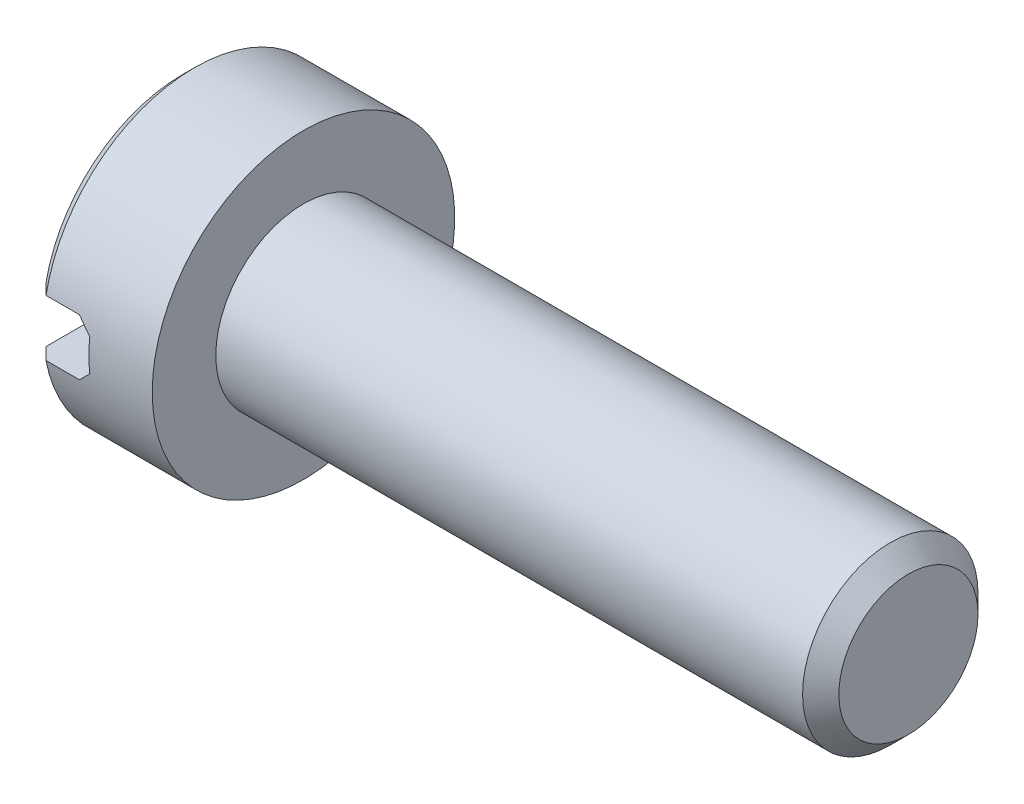
ISO-10303-21;
HEADER;
FILE_DESCRIPTION(('STEP AP214'),'2;1');
FILE_NAME('part.step','',(''),(''),'','','');
FILE_SCHEMA(('AUTOMOTIVE_DESIGN { 1 0 10303 214 1 1 1 1 }'));
ENDSEC;
DATA;
#1=APPLICATION_CONTEXT('core data for automotive mechanical design processes');
#2=APPLICATION_PROTOCOL_DEFINITION('international standard','automotive_design',2000,#1);
#3=PRODUCT_CONTEXT('',#1,'mechanical');
#4=PRODUCT('Part','Part','',(#3));
#5=PRODUCT_RELATED_PRODUCT_CATEGORY('part','',(#4));
#6=PRODUCT_DEFINITION_FORMATION('','',#4);
#7=PRODUCT_DEFINITION_CONTEXT('part definition',#1,'design');
#8=PRODUCT_DEFINITION('design','',#6,#7);
#9=PRODUCT_DEFINITION_SHAPE('','',#8);
#10=(LENGTH_UNIT() NAMED_UNIT(*) SI_UNIT(.MILLI.,.METRE.));
#11=(NAMED_UNIT(*) PLANE_ANGLE_UNIT() SI_UNIT($,.RADIAN.));
#12=(NAMED_UNIT(*) SI_UNIT($,.STERADIAN.) SOLID_ANGLE_UNIT());
#13=UNCERTAINTY_MEASURE_WITH_UNIT(LENGTH_MEASURE(1.E-05),#10,'distance_accuracy_value','');
#14=(GEOMETRIC_REPRESENTATION_CONTEXT(3) GLOBAL_UNCERTAINTY_ASSIGNED_CONTEXT((#13)) GLOBAL_UNIT_ASSIGNED_CONTEXT((#10,
#11,#12)) REPRESENTATION_CONTEXT('',''));
#15=CARTESIAN_POINT('',(0.,0.,0.));
#16=DIRECTION('',(0.,0.,1.));
#17=DIRECTION('',(1.,0.,0.));
#18=AXIS2_PLACEMENT_3D('',#15,#16,#17);
#19=CARTESIAN_POINT('',(2.,2.5,0.));
#20=DIRECTION('',(-1.,0.,0.));
#21=DIRECTION('',(0.,0.,1.));
#22=AXIS2_PLACEMENT_3D('',#19,#20,#21);
#23=PLANE('',#22);
#24=CARTESIAN_POINT('',(2.,0.,0.));
#25=DIRECTION('',(-1.,0.,0.));
#26=DIRECTION('',(0.,0.,1.));
#27=AXIS2_PLACEMENT_3D('',#24,#25,#26);
#28=CIRCLE('',#27,2.5);
#29=CARTESIAN_POINT('',(2.,0.,2.5));
#30=VERTEX_POINT('',#29);
#31=EDGE_CURVE('E191',#30,#30,#28,.T.);
#32=ORIENTED_EDGE('',*,*,#31,.F.);
#33=EDGE_LOOP('',(#32));
#34=FACE_BOUND('',#33,.T.);
#35=CARTESIAN_POINT('',(2.,0.,0.));
#36=DIRECTION('',(-1.,0.,0.));
#37=DIRECTION('',(0.,0.,1.));
#38=AXIS2_PLACEMENT_3D('',#35,#36,#37);
#39=CIRCLE('',#38,1.45);
#40=CARTESIAN_POINT('',(2.,0.,1.45));
#41=VERTEX_POINT('',#40);
#42=EDGE_CURVE('E140',#41,#41,#39,.F.);
#43=ORIENTED_EDGE('',*,*,#42,.F.);
#44=EDGE_LOOP('',(#43));
#45=FACE_BOUND('',#44,.T.);
#46=ADVANCED_FACE('F28',(#34,#45),#23,.F.);
#47=CARTESIAN_POINT('',(0.,0.,0.));
#48=DIRECTION('',(1.,0.,0.));
#49=DIRECTION('',(0.,0.,-1.));
#50=AXIS2_PLACEMENT_3D('',#47,#48,#49);
#51=PLANE('',#50);
#52=CARTESIAN_POINT('',(0.,0.,0.));
#53=DIRECTION('',(-1.,0.,0.));
#54=DIRECTION('',(0.,0.,1.));
#55=AXIS2_PLACEMENT_3D('',#52,#53,#54);
#56=CIRCLE('',#55,2.3);
#57=CARTESIAN_POINT('',(0.,0.465549348230913,2.25239068644003));
#58=VERTEX_POINT('',#57);
#59=CARTESIAN_POINT('',(0.,0.465549348230913,-2.25239068644003));
#60=VERTEX_POINT('',#59);
#61=EDGE_CURVE('E110',#58,#60,#56,.T.);
#62=ORIENTED_EDGE('',*,*,#61,.T.);
#63=DIRECTION('',(0.,0.,1.));
#64=VECTOR('',#63,1.);
#65=CARTESIAN_POINT('',(0.,0.465549348230913,-5.));
#66=LINE('',#65,#64);
#67=EDGE_CURVE('E103',#60,#58,#66,.T.);
#68=ORIENTED_EDGE('',*,*,#67,.T.);
#69=EDGE_LOOP('',(#62,#68));
#70=FACE_BOUND('',#69,.T.);
#71=ADVANCED_FACE('F158',(#70),#51,.F.);
#72=CARTESIAN_POINT('',(0.2,0.,0.));
#73=DIRECTION('',(1.,0.,0.));
#74=DIRECTION('',(0.,0.,-1.));
#75=AXIS2_PLACEMENT_3D('',#72,#73,#74);
#76=CONICAL_SURFACE('',#75,2.5,0.785398163397449);
#77=CARTESIAN_POINT('',(0.2,0.,0.));
#78=DIRECTION('',(-1.,0.,0.));
#79=DIRECTION('',(0.,0.,1.));
#80=AXIS2_PLACEMENT_3D('',#77,#78,#79);
#81=CIRCLE('',#80,2.5);
#82=CARTESIAN_POINT('',(0.2,0.465549348230913,2.45627030360296));
#83=VERTEX_POINT('',#82);
#84=CARTESIAN_POINT('',(0.2,0.465549348230913,-2.45627030360296));
#85=VERTEX_POINT('',#84);
#86=EDGE_CURVE('E111',#83,#85,#81,.T.);
#87=ORIENTED_EDGE('',*,*,#86,.T.);
#88=CARTESIAN_POINT('',(3.20259904076723,0.465549348230913,-5.48286968729098));
#89=CARTESIAN_POINT('',(3.00738145959935,0.465549348230913,-5.28694329289562));
#90=CARTESIAN_POINT('',(2.81219546067579,0.465549348230913,-5.09098538985915));
#91=CARTESIAN_POINT('',(2.42191937891038,0.465549348230913,-4.69895178557872));
#92=CARTESIAN_POINT('',(2.22682930219255,0.465549348230913,-4.50287607823863));
#93=CARTESIAN_POINT('',(1.83653240706012,0.465549348230913,-4.11030517611593));
#94=CARTESIAN_POINT('',(1.64132579611623,0.465549348230913,-3.9138097750014));
#95=CARTESIAN_POINT('',(1.25115924421648,0.465549348230913,-3.52059587027371));
#96=CARTESIAN_POINT('',(1.05619929014715,0.465549348230913,-3.32387737967476));
#97=CARTESIAN_POINT('',(0.678173026290478,0.465549348230913,-2.9416895419363));
#98=CARTESIAN_POINT('',(0.495084501131994,0.465549348230913,-2.7562421918476));
#99=CARTESIAN_POINT('',(0.220902938364085,0.465549348230913,-2.47759625217052));
#100=CARTESIAN_POINT('',(0.129576630819242,0.465549348230913,-2.38462728539378));
#101=CARTESIAN_POINT('',(-0.0528521527638664,0.465549348230913,-2.19847287291091));
#102=CARTESIAN_POINT('',(-0.143954632395984,0.465549348230913,-2.10528743072794));
#103=CARTESIAN_POINT('',(-0.325762187411694,0.465549348230913,-1.91867757427864));
#104=CARTESIAN_POINT('',(-0.416467526691369,0.465549348230913,-1.82525341749482));
#105=CARTESIAN_POINT('',(-0.597381873326261,0.465549348230913,-1.63791440165395));
#106=CARTESIAN_POINT('',(-0.687590849458516,0.465549348230913,-1.54399951243647));
#107=CARTESIAN_POINT('',(-0.867162247825724,0.465549348230913,-1.3554114454591));
#108=CARTESIAN_POINT('',(-0.956524909350582,0.465549348230913,-1.26073849690962));
#109=CARTESIAN_POINT('',(-1.08939468495382,0.465549348230913,-1.11764625640034));
#110=CARTESIAN_POINT('',(-1.1334867082123,0.465549348230913,-1.06977082072954));
#111=CARTESIAN_POINT('',(-1.2210969597667,0.465549348230913,-0.973498550024909));
#112=CARTESIAN_POINT('',(-1.26461520900373,0.465549348230913,-0.925101734137766));
#113=CARTESIAN_POINT('',(-1.3317610681347,0.465549348230913,-0.849065289158111));
#114=CARTESIAN_POINT('',(-1.35569012099074,0.465549348230913,-0.821692131835998));
#115=CARTESIAN_POINT('',(-1.40319102244514,0.465549348230913,-0.766632100193609));
#116=CARTESIAN_POINT('',(-1.42676283514449,0.465549348230913,-0.73894519482706));
#117=CARTESIAN_POINT('',(-1.47366376684455,0.465549348230913,-0.682886365346766));
#118=CARTESIAN_POINT('',(-1.49698800292058,0.465549348230913,-0.654510342179644));
#119=CARTESIAN_POINT('',(-1.54295549742156,0.465549348230913,-0.597221058712914));
#120=CARTESIAN_POINT('',(-1.56559892715386,0.465549348230913,-0.568307936573488));
#121=CARTESIAN_POINT('',(-1.61016736197608,0.465549348230913,-0.509419742712258));
#122=CARTESIAN_POINT('',(-1.63208156923063,0.465549348230913,-0.479436434264725));
#123=CARTESIAN_POINT('',(-1.67445976083722,0.465549348230913,-0.418389024408675));
#124=CARTESIAN_POINT('',(-1.69492180209863,0.465549348230913,-0.387323554832705));
#125=CARTESIAN_POINT('',(-1.73332185678116,0.465549348230913,-0.324061124181559));
#126=CARTESIAN_POINT('',(-1.75128287953761,0.465549348230913,-0.291878431816847));
#127=CARTESIAN_POINT('',(-1.78342369621955,0.465549348230913,-0.225717265309184));
#128=CARTESIAN_POINT('',(-1.79761500076547,0.465549348230913,-0.191744646392133));
#129=CARTESIAN_POINT('',(-1.81895609795713,0.465549348230913,-0.124795883091766));
#130=CARTESIAN_POINT('',(-1.8266128932659,0.465549348230913,-0.0919921322132611));
#131=CARTESIAN_POINT('',(-1.83488894775632,0.465549348230913,-0.0256267496241762));
#132=CARTESIAN_POINT('',(-1.83554895937427,0.465549348230913,0.00792935132869227));
#133=CARTESIAN_POINT('',(-1.82973306120756,0.465549348230913,0.0742464015597508));
#134=CARTESIAN_POINT('',(-1.82328333400206,0.465549348230913,0.107009817283791));
#135=CARTESIAN_POINT('',(-1.80956338762447,0.465549348230913,0.155027331571199));
#136=CARTESIAN_POINT('',(-1.80428518983903,0.465549348230913,0.170909212358321));
#137=CARTESIAN_POINT('',(-1.79261948745361,0.465549348230913,0.202260246274237));
#138=CARTESIAN_POINT('',(-1.78623214101843,0.465549348230913,0.217729457887391));
#139=CARTESIAN_POINT('',(-1.76761840023324,0.465549348230913,0.259328209218331));
#140=CARTESIAN_POINT('',(-1.7545143196465,0.465549348230913,0.285061417842786));
#141=CARTESIAN_POINT('',(-1.72651469614149,0.465549348230913,0.335544158020592));
#142=CARTESIAN_POINT('',(-1.71161720540743,0.465549348230913,0.360292580485516));
#143=CARTESIAN_POINT('',(-1.68054228203642,0.465549348230913,0.409079841714359));
#144=CARTESIAN_POINT('',(-1.66436078635795,0.465549348230913,0.433116068257987));
#145=CARTESIAN_POINT('',(-1.63111775750428,0.465549348230913,0.480575042863358));
#146=CARTESIAN_POINT('',(-1.61405601084805,0.465549348230913,0.503997640009445));
#147=CARTESIAN_POINT('',(-1.5616167270468,0.465549348230913,0.573971640763827));
#148=CARTESIAN_POINT('',(-1.52527399334495,0.465549348230913,0.619796593427046));
#149=CARTESIAN_POINT('',(-1.45124163289229,0.465549348230913,0.710149565111901));
#150=CARTESIAN_POINT('',(-1.41355526157427,0.465549348230913,0.7546802997551));
#151=CARTESIAN_POINT('',(-1.33810033893443,0.465549348230913,0.842013934301668));
#152=CARTESIAN_POINT('',(-1.30035092246978,0.465549348230913,0.884833404050981));
#153=CARTESIAN_POINT('',(-1.22427339982634,0.465549348230913,0.969954837541984));
#154=CARTESIAN_POINT('',(-1.18594527816913,0.465549348230913,1.01225678738678));
#155=CARTESIAN_POINT('',(-1.07035214447441,0.465549348230913,1.13862723555416));
#156=CARTESIAN_POINT('',(-0.992489260170284,0.465549348230913,1.22214795765609));
#157=CARTESIAN_POINT('',(-0.835814007667518,0.465549348230913,1.38847609582379));
#158=CARTESIAN_POINT('',(-0.757000620957103,0.465549348230913,1.47128254610905));
#159=CARTESIAN_POINT('',(-0.598849232799755,0.465549348230913,1.63637982121664));
#160=CARTESIAN_POINT('',(-0.519511274422271,0.465549348230913,1.71867068731607));
#161=CARTESIAN_POINT('',(-0.361217712976167,0.465549348230913,1.88216701603883));
#162=CARTESIAN_POINT('',(-0.282265248575711,0.465549348230913,1.9633755225318));
#163=CARTESIAN_POINT('',(-0.124123333736655,0.465549348230913,2.12556467511988));
#164=CARTESIAN_POINT('',(-0.044933878372658,0.465549348230913,2.20654531641042));
#165=CARTESIAN_POINT('',(0.192811054539122,0.465549348230913,2.44916767308598));
#166=CARTESIAN_POINT('',(0.351615992082501,0.465549348230913,2.61056482504039));
#167=CARTESIAN_POINT('',(0.732972757071635,0.465549348230913,2.99726131212903));
#168=CARTESIAN_POINT('',(0.955700706319338,0.465549348230913,3.22238674752163));
#169=CARTESIAN_POINT('',(1.401572977937,0.465549348230913,3.67230050679293));
#170=CARTESIAN_POINT('',(1.62471736464727,0.465549348230913,3.89708876686418));
#171=CARTESIAN_POINT('',(2.07358635321307,0.465549348230913,4.34881324556589));
#172=CARTESIAN_POINT('',(2.29931333445495,0.465549348230913,4.57574709913376));
#173=CARTESIAN_POINT('',(2.7508805263624,0.465549348230913,5.02942321622607));
#174=CARTESIAN_POINT('',(2.97672071035442,0.465549348230913,5.2561655062971));
#175=CARTESIAN_POINT('',(3.20259904076724,0.465549348230913,5.48286968729098));
#176=B_SPLINE_CURVE_WITH_KNOTS('',3,(#88,#89,#90,#91,#92,#93,#94,#95,#96,#97,#98,#99,#100,#101,
#102,#103,#104,#105,#106,#107,#108,#109,#110,#111,#112,#113,#114,#115,#116,#117,#118,#119,#120,
#121,#122,#123,#124,#125,#126,#127,#128,#129,#130,#131,#132,#133,#134,#135,#136,#137,#138,#139,
#140,#141,#142,#143,#144,#145,#146,#147,#148,#149,#150,#151,#152,#153,#154,#155,#156,#157,#158,
#159,#160,#161,#162,#163,#164,#165,#166,#167,#168,#169,#170,#171,#172,#173,#174,#175),
.UNSPECIFIED.,.F.,.F.,(4,2,2,2,2,2,2,2,2,2,2,2,2,2,2,2,2,2,2,2,2,2,2,2,2,2,2,2,2,2,2,2,2,2,2,2,
2,2,2,2,2,2,2,4),(0.,0.829743073340608,1.65953360095567,2.49046340540357,3.3213470024816,
4.10314469139847,4.49410926633512,4.88506752224857,5.27570632324448,5.66636942212084,
6.05691855181897,6.25217337755999,6.44742105722462,6.55649218217525,6.66557419594665,
6.77576205404667,6.88592195014922,6.99730763492697,7.10883965543405,7.21926609048524,
7.32935136450646,7.42981570469559,7.52969457133972,7.62920684560584,7.67938417859199,
7.72955436214783,7.81607261219315,7.90268569183183,7.9895847021618,8.07650488747965,
8.25190336684877,8.42690244879081,8.59814445390702,8.76939104731505,9.11193368974146,
9.45488345933612,9.79780541262763,10.1375912828317,10.4773842645597,11.1566564623285,
12.1067097788694,13.0569245869456,14.0171665517813,14.9772407465216),.UNSPECIFIED.);
#177=EDGE_CURVE('E51',#85,#60,#176,.T.);
#178=ORIENTED_EDGE('',*,*,#177,.T.);
#179=ORIENTED_EDGE('',*,*,#61,.F.);
#180=EDGE_CURVE('E185',#58,#83,#176,.T.);
#181=ORIENTED_EDGE('',*,*,#180,.T.);
#182=EDGE_LOOP('',(#87,#178,#179,#181));
#183=FACE_BOUND('',#182,.T.);
#184=ADVANCED_FACE('F166',(#183),#76,.T.);
#185=CARTESIAN_POINT('',(0.,-0.465549348230913,-2.25239068644003));
#186=VERTEX_POINT('',#185);
#187=CARTESIAN_POINT('',(0.,-0.465549348230913,2.25239068644003));
#188=VERTEX_POINT('',#187);
#189=EDGE_CURVE('E107',#186,#188,#56,.T.);
#190=ORIENTED_EDGE('',*,*,#189,.T.);
#191=DIRECTION('',(0.,0.,1.));
#192=VECTOR('',#191,1.);
#193=CARTESIAN_POINT('',(0.,-0.465549348230913,-5.));
#194=LINE('',#193,#192);
#195=EDGE_CURVE('E94',#186,#188,#194,.T.);
#196=ORIENTED_EDGE('',*,*,#195,.F.);
#197=EDGE_LOOP('',(#190,#196));
#198=FACE_BOUND('',#197,.T.);
#199=ADVANCED_FACE('F30',(#198),#51,.F.);
#200=CARTESIAN_POINT('',(0.2,-0.465549348230913,-2.45627030360296));
#201=VERTEX_POINT('',#200);
#202=CARTESIAN_POINT('',(0.2,-0.465549348230913,2.45627030360296));
#203=VERTEX_POINT('',#202);
#204=EDGE_CURVE('E115',#201,#203,#81,.T.);
#205=ORIENTED_EDGE('',*,*,#204,.T.);
#206=CARTESIAN_POINT('',(3.20259904076724,-0.465549348230913,5.48286968729098));
#207=CARTESIAN_POINT('',(3.00738145959935,-0.465549348230913,5.28694329289562));
#208=CARTESIAN_POINT('',(2.81219546067579,-0.465549348230913,5.09098538985916));
#209=CARTESIAN_POINT('',(2.42191937891038,-0.465549348230913,4.69895178557872));
#210=CARTESIAN_POINT('',(2.22682930219255,-0.465549348230913,4.50287607823863));
#211=CARTESIAN_POINT('',(1.83653240706012,-0.465549348230913,4.11030517611593));
#212=CARTESIAN_POINT('',(1.64132579611623,-0.465549348230913,3.9138097750014));
#213=CARTESIAN_POINT('',(1.25115924421648,-0.465549348230913,3.52059587027371));
#214=CARTESIAN_POINT('',(1.05619929014715,-0.465549348230913,3.32387737967475));
#215=CARTESIAN_POINT('',(0.678173026290476,-0.465549348230913,2.9416895419363));
#216=CARTESIAN_POINT('',(0.495084501131992,-0.465549348230913,2.75624219184759));
#217=CARTESIAN_POINT('',(0.220902938364083,-0.465549348230913,2.47759625217052));
#218=CARTESIAN_POINT('',(0.12957663081924,-0.465549348230913,2.38462728539378));
#219=CARTESIAN_POINT('',(-0.0528521527638681,-0.465549348230913,2.19847287291091));
#220=CARTESIAN_POINT('',(-0.143954632395986,-0.465549348230913,2.10528743072794));
#221=CARTESIAN_POINT('',(-0.325762187411696,-0.465549348230913,1.91867757427864));
#222=CARTESIAN_POINT('',(-0.41646752669137,-0.465549348230913,1.82525341749482));
#223=CARTESIAN_POINT('',(-0.597381873326262,-0.465549348230913,1.63791440165395));
#224=CARTESIAN_POINT('',(-0.687590849458517,-0.465549348230913,1.54399951243647));
#225=CARTESIAN_POINT('',(-0.867162247825725,-0.465549348230913,1.3554114454591));
#226=CARTESIAN_POINT('',(-0.956524909350583,-0.465549348230913,1.26073849690962));
#227=CARTESIAN_POINT('',(-1.08939468495382,-0.465549348230913,1.11764625640034));
#228=CARTESIAN_POINT('',(-1.1334867082123,-0.465549348230913,1.06977082072953));
#229=CARTESIAN_POINT('',(-1.2210969597667,-0.465549348230913,0.973498550024909));
#230=CARTESIAN_POINT('',(-1.26461520900373,-0.465549348230913,0.925101734137766));
#231=CARTESIAN_POINT('',(-1.33176106813471,-0.465549348230913,0.84906528915811));
#232=CARTESIAN_POINT('',(-1.35569012099074,-0.465549348230913,0.821692131835997));
#233=CARTESIAN_POINT('',(-1.40319102244514,-0.465549348230913,0.766632100193609));
#234=CARTESIAN_POINT('',(-1.42676283514449,-0.465549348230913,0.738945194827059));
#235=CARTESIAN_POINT('',(-1.47366376684455,-0.465549348230913,0.682886365346765));
#236=CARTESIAN_POINT('',(-1.49698800292058,-0.465549348230913,0.654510342179643));
#237=CARTESIAN_POINT('',(-1.54295549742156,-0.465549348230913,0.597221058712913));
#238=CARTESIAN_POINT('',(-1.56559892715386,-0.465549348230913,0.568307936573487));
#239=CARTESIAN_POINT('',(-1.61016736197608,-0.465549348230913,0.509419742712257));
#240=CARTESIAN_POINT('',(-1.63208156923063,-0.465549348230913,0.479436434264725));
#241=CARTESIAN_POINT('',(-1.67445976083722,-0.465549348230913,0.418389024408674));
#242=CARTESIAN_POINT('',(-1.69492180209863,-0.465549348230913,0.387323554832704));
#243=CARTESIAN_POINT('',(-1.73332185678116,-0.465549348230913,0.324061124181558));
#244=CARTESIAN_POINT('',(-1.75128287953761,-0.465549348230913,0.291878431816847));
#245=CARTESIAN_POINT('',(-1.78342369621955,-0.465549348230913,0.225717265309183));
#246=CARTESIAN_POINT('',(-1.79761500076547,-0.465549348230913,0.191744646392132));
#247=CARTESIAN_POINT('',(-1.81895609795713,-0.465549348230913,0.124795883091765));
#248=CARTESIAN_POINT('',(-1.8266128932659,-0.465549348230913,0.0919921322132606));
#249=CARTESIAN_POINT('',(-1.83488894775632,-0.465549348230913,0.0256267496241758));
#250=CARTESIAN_POINT('',(-1.83554895937427,-0.465549348230913,-0.00792935132869264));
#251=CARTESIAN_POINT('',(-1.82973306120756,-0.465549348230913,-0.0742464015597512));
#252=CARTESIAN_POINT('',(-1.82328333400206,-0.465549348230913,-0.107009817283792));
#253=CARTESIAN_POINT('',(-1.80956338762447,-0.465549348230913,-0.155027331571199));
#254=CARTESIAN_POINT('',(-1.80428518983903,-0.465549348230913,-0.170909212358322));
#255=CARTESIAN_POINT('',(-1.79261948745361,-0.465549348230913,-0.202260246274238));
#256=CARTESIAN_POINT('',(-1.78623214101843,-0.465549348230913,-0.217729457887391));
#257=CARTESIAN_POINT('',(-1.76761840023324,-0.465549348230913,-0.259328209218332));
#258=CARTESIAN_POINT('',(-1.7545143196465,-0.465549348230913,-0.285061417842787));
#259=CARTESIAN_POINT('',(-1.72651469614149,-0.465549348230913,-0.335544158020594));
#260=CARTESIAN_POINT('',(-1.71161720540743,-0.465549348230913,-0.360292580485518));
#261=CARTESIAN_POINT('',(-1.68054228203642,-0.465549348230913,-0.40907984171436));
#262=CARTESIAN_POINT('',(-1.66436078635794,-0.465549348230913,-0.433116068257989));
#263=CARTESIAN_POINT('',(-1.63111775750427,-0.465549348230913,-0.48057504286336));
#264=CARTESIAN_POINT('',(-1.61405601084805,-0.465549348230913,-0.503997640009447));
#265=CARTESIAN_POINT('',(-1.5616167270468,-0.465549348230913,-0.573971640763828));
#266=CARTESIAN_POINT('',(-1.52527399334495,-0.465549348230913,-0.619796593427047));
#267=CARTESIAN_POINT('',(-1.45124163289228,-0.465549348230913,-0.710149565111902));
#268=CARTESIAN_POINT('',(-1.41355526157427,-0.465549348230913,-0.754680299755101));
#269=CARTESIAN_POINT('',(-1.33810033893443,-0.465549348230913,-0.842013934301668));
#270=CARTESIAN_POINT('',(-1.30035092246978,-0.465549348230913,-0.88483340405098));
#271=CARTESIAN_POINT('',(-1.22427339982634,-0.465549348230913,-0.969954837541984));
#272=CARTESIAN_POINT('',(-1.18594527816912,-0.465549348230913,-1.01225678738678));
#273=CARTESIAN_POINT('',(-1.07035214447441,-0.465549348230913,-1.13862723555416));
#274=CARTESIAN_POINT('',(-0.992489260170283,-0.465549348230913,-1.2221479576561));
#275=CARTESIAN_POINT('',(-0.835814007667517,-0.465549348230913,-1.38847609582379));
#276=CARTESIAN_POINT('',(-0.757000620957102,-0.465549348230913,-1.47128254610905));
#277=CARTESIAN_POINT('',(-0.598849232799754,-0.465549348230913,-1.63637982121664));
#278=CARTESIAN_POINT('',(-0.51951127442227,-0.465549348230913,-1.71867068731607));
#279=CARTESIAN_POINT('',(-0.361217712976166,-0.465549348230913,-1.88216701603883));
#280=CARTESIAN_POINT('',(-0.282265248575709,-0.465549348230913,-1.9633755225318));
#281=CARTESIAN_POINT('',(-0.124123333736654,-0.465549348230913,-2.12556467511988));
#282=CARTESIAN_POINT('',(-0.0449338783726567,-0.465549348230913,-2.20654531641042));
#283=CARTESIAN_POINT('',(0.192811054539124,-0.465549348230913,-2.44916767308598));
#284=CARTESIAN_POINT('',(0.351615992082503,-0.465549348230913,-2.6105648250404));
#285=CARTESIAN_POINT('',(0.732972757071637,-0.465549348230913,-2.99726131212903));
#286=CARTESIAN_POINT('',(0.95570070631934,-0.465549348230913,-3.22238674752163));
#287=CARTESIAN_POINT('',(1.401572977937,-0.465549348230913,-3.67230050679293));
#288=CARTESIAN_POINT('',(1.62471736464727,-0.465549348230913,-3.89708876686418));
#289=CARTESIAN_POINT('',(2.07358635321307,-0.465549348230913,-4.34881324556589));
#290=CARTESIAN_POINT('',(2.29931333445495,-0.465549348230913,-4.57574709913376));
#291=CARTESIAN_POINT('',(2.75088052636241,-0.465549348230913,-5.02942321622608));
#292=CARTESIAN_POINT('',(2.97672071035443,-0.465549348230913,-5.2561655062971));
#293=CARTESIAN_POINT('',(3.20259904076724,-0.465549348230913,-5.48286968729098));
#294=B_SPLINE_CURVE_WITH_KNOTS('',3,(#206,#207,#208,#209,#210,#211,#212,#213,#214,#215,#216,
#217,#218,#219,#220,#221,#222,#223,#224,#225,#226,#227,#228,#229,#230,#231,#232,#233,#234,#235,
#236,#237,#238,#239,#240,#241,#242,#243,#244,#245,#246,#247,#248,#249,#250,#251,#252,#253,#254,
#255,#256,#257,#258,#259,#260,#261,#262,#263,#264,#265,#266,#267,#268,#269,#270,#271,#272,#273,
#274,#275,#276,#277,#278,#279,#280,#281,#282,#283,#284,#285,#286,#287,#288,#289,#290,#291,#292,
#293),.UNSPECIFIED.,.F.,.F.,(4,2,2,2,2,2,2,2,2,2,2,2,2,2,2,2,2,2,2,2,2,2,2,2,2,2,2,2,2,2,2,2,2,
2,2,2,2,2,2,2,2,2,2,4),(0.,0.82974307334061,1.65953360095567,2.49046340540358,3.32134700248161,
4.10314469139847,4.49410926633512,4.88506752224858,5.27570632324449,5.66636942212084,
6.05691855181898,6.25217337756,6.44742105722463,6.55649218217526,6.66557419594665,
6.77576205404667,6.88592195014922,6.99730763492697,7.10883965543406,7.21926609048525,
7.32935136450647,7.42981570469559,7.52969457133973,7.62920684560584,7.67938417859199,
7.72955436214784,7.81607261219315,7.90268569183183,7.98958470216181,8.07650488747966,
8.25190336684877,8.42690244879082,8.59814445390702,8.76939104731506,9.11193368974146,
9.45488345933612,9.79780541262763,10.1375912828317,10.4773842645597,11.1566564623285,
12.1067097788694,13.0569245869456,14.0171665517813,14.9772407465216),.UNSPECIFIED.);
#295=EDGE_CURVE('E102',#203,#188,#294,.T.);
#296=ORIENTED_EDGE('',*,*,#295,.T.);
#297=ORIENTED_EDGE('',*,*,#189,.F.);
#298=EDGE_CURVE('E91',#186,#201,#294,.T.);
#299=ORIENTED_EDGE('',*,*,#298,.T.);
#300=EDGE_LOOP('',(#205,#296,#297,#299));
#301=FACE_BOUND('',#300,.T.);
#302=ADVANCED_FACE('F109',(#301),#76,.T.);
#303=CARTESIAN_POINT('',(0.,0.,0.));
#304=DIRECTION('',(-1.,0.,0.));
#305=DIRECTION('',(0.,0.,1.));
#306=AXIS2_PLACEMENT_3D('',#303,#304,#305);
#307=CYLINDRICAL_SURFACE('',#306,2.5);
#308=ORIENTED_EDGE('',*,*,#86,.F.);
#309=DIRECTION('',(-1.,0.,0.));
#310=VECTOR('',#309,1.);
#311=CARTESIAN_POINT('',(0.,0.465549348230913,2.45627030360296));
#312=LINE('',#311,#310);
#313=CARTESIAN_POINT('',(0.753445065176908,0.465549348230913,2.45627030360296));
#314=VERTEX_POINT('',#313);
#315=EDGE_CURVE('E137',#83,#314,#312,.F.);
#316=ORIENTED_EDGE('',*,*,#315,.T.);
#317=CARTESIAN_POINT('',(1.21899441340782,0.,0.));
#318=DIRECTION('',(0.707106781186548,0.707106781186548,0.));
#319=DIRECTION('',(-0.707106781186548,0.707106781186548,0.));
#320=AXIS2_PLACEMENT_3D('',#317,#318,#319);
#321=ELLIPSE('',#320,3.53553390593274,2.5);
#322=CARTESIAN_POINT('',(0.953445065176908,0.265549348230913,2.48585670215605));
#323=VERTEX_POINT('',#322);
#324=EDGE_CURVE('E132',#314,#323,#321,.T.);
#325=ORIENTED_EDGE('',*,*,#324,.T.);
#326=CARTESIAN_POINT('',(0.953445065176908,0.,0.));
#327=DIRECTION('',(1.,0.,0.));
#328=DIRECTION('',(0.,0.,-1.));
#329=AXIS2_PLACEMENT_3D('',#326,#327,#328);
#330=CIRCLE('',#329,2.5);
#331=CARTESIAN_POINT('',(0.953445065176908,-0.265549348230913,2.48585670215605));
#332=VERTEX_POINT('',#331);
#333=EDGE_CURVE('E128',#323,#332,#330,.T.);
#334=ORIENTED_EDGE('',*,*,#333,.T.);
#335=CARTESIAN_POINT('',(1.21899441340782,0.,0.));
#336=DIRECTION('',(0.707106781186548,-0.707106781186548,0.));
#337=DIRECTION('',(-0.707106781186548,-0.707106781186548,0.));
#338=AXIS2_PLACEMENT_3D('',#335,#336,#337);
#339=ELLIPSE('',#338,3.53553390593274,2.5);
#340=CARTESIAN_POINT('',(0.753445065176908,-0.465549348230913,2.45627030360296));
#341=VERTEX_POINT('',#340);
#342=EDGE_CURVE('E124',#332,#341,#339,.T.);
#343=ORIENTED_EDGE('',*,*,#342,.T.);
#344=DIRECTION('',(-1.,0.,0.));
#345=VECTOR('',#344,1.);
#346=CARTESIAN_POINT('',(0.,-0.465549348230913,2.45627030360296));
#347=LINE('',#346,#345);
#348=EDGE_CURVE('E134',#341,#203,#347,.T.);
#349=ORIENTED_EDGE('',*,*,#348,.T.);
#350=ORIENTED_EDGE('',*,*,#204,.F.);
#351=DIRECTION('',(-1.,0.,0.));
#352=VECTOR('',#351,1.);
#353=CARTESIAN_POINT('',(0.,-0.465549348230913,-2.45627030360296));
#354=LINE('',#353,#352);
#355=CARTESIAN_POINT('',(0.753445065176908,-0.465549348230913,-2.45627030360296));
#356=VERTEX_POINT('',#355);
#357=EDGE_CURVE('E97',#201,#356,#354,.F.);
#358=ORIENTED_EDGE('',*,*,#357,.T.);
#359=CARTESIAN_POINT('',(0.953445065176908,-0.265549348230913,-2.48585670215605));
#360=VERTEX_POINT('',#359);
#361=EDGE_CURVE('E120',#356,#360,#339,.T.);
#362=ORIENTED_EDGE('',*,*,#361,.T.);
#363=CARTESIAN_POINT('',(0.953445065176908,0.265549348230913,-2.48585670215605));
#364=VERTEX_POINT('',#363);
#365=EDGE_CURVE('E123',#360,#364,#330,.T.);
#366=ORIENTED_EDGE('',*,*,#365,.T.);
#367=CARTESIAN_POINT('',(0.753445065176908,0.465549348230913,-2.45627030360296));
#368=VERTEX_POINT('',#367);
#369=EDGE_CURVE('E127',#364,#368,#321,.T.);
#370=ORIENTED_EDGE('',*,*,#369,.T.);
#371=DIRECTION('',(-1.,0.,0.));
#372=VECTOR('',#371,1.);
#373=CARTESIAN_POINT('',(0.,0.465549348230913,-2.45627030360296));
#374=LINE('',#373,#372);
#375=EDGE_CURVE('E131',#368,#85,#374,.T.);
#376=ORIENTED_EDGE('',*,*,#375,.T.);
#377=EDGE_LOOP('',(#308,#316,#325,#334,#343,#349,#350,#358,#362,#366,#370,#376));
#378=FACE_BOUND('',#377,.T.);
#379=ORIENTED_EDGE('',*,*,#31,.T.);
#380=EDGE_LOOP('',(#379));
#381=FACE_BOUND('',#380,.T.);
#382=ADVANCED_FACE('F174',(#378,#381),#307,.T.);
#383=CARTESIAN_POINT('',(0.,0.465549348230913,-5.));
#384=DIRECTION('',(0.,1.,0.));
#385=DIRECTION('',(0.,0.,1.));
#386=AXIS2_PLACEMENT_3D('',#383,#384,#385);
#387=PLANE('',#386);
#388=ORIENTED_EDGE('',*,*,#375,.F.);
#389=DIRECTION('',(0.,0.,1.));
#390=VECTOR('',#389,1.);
#391=CARTESIAN_POINT('',(0.753445065176908,0.465549348230913,-5.));
#392=LINE('',#391,#390);
#393=EDGE_CURVE('E220',#368,#314,#392,.T.);
#394=ORIENTED_EDGE('',*,*,#393,.T.);
#395=ORIENTED_EDGE('',*,*,#315,.F.);
#396=ORIENTED_EDGE('',*,*,#180,.F.);
#397=ORIENTED_EDGE('',*,*,#67,.F.);
#398=ORIENTED_EDGE('',*,*,#177,.F.);
#399=EDGE_LOOP('',(#388,#394,#395,#396,#397,#398));
#400=FACE_BOUND('',#399,.T.);
#401=ADVANCED_FACE('F176',(#400),#387,.F.);
#402=CARTESIAN_POINT('',(0.753445065176908,0.465549348230913,-5.));
#403=DIRECTION('',(0.707106781186548,0.707106781186548,0.));
#404=DIRECTION('',(-0.707106781186548,0.707106781186548,0.));
#405=AXIS2_PLACEMENT_3D('',#402,#403,#404);
#406=PLANE('',#405);
#407=ORIENTED_EDGE('',*,*,#393,.F.);
#408=ORIENTED_EDGE('',*,*,#369,.F.);
#409=DIRECTION('',(0.,0.,1.));
#410=VECTOR('',#409,1.);
#411=CARTESIAN_POINT('',(0.953445065176908,0.265549348230913,-5.));
#412=LINE('',#411,#410);
#413=EDGE_CURVE('E222',#364,#323,#412,.T.);
#414=ORIENTED_EDGE('',*,*,#413,.T.);
#415=ORIENTED_EDGE('',*,*,#324,.F.);
#416=EDGE_LOOP('',(#407,#408,#414,#415));
#417=FACE_BOUND('',#416,.T.);
#418=ADVANCED_FACE('F196',(#417),#406,.F.);
#419=CARTESIAN_POINT('',(0.953445065176908,0.265549348230913,-5.));
#420=DIRECTION('',(1.,0.,0.));
#421=DIRECTION('',(0.,0.,-1.));
#422=AXIS2_PLACEMENT_3D('',#419,#420,#421);
#423=PLANE('',#422);
#424=ORIENTED_EDGE('',*,*,#413,.F.);
#425=ORIENTED_EDGE('',*,*,#365,.F.);
#426=DIRECTION('',(0.,0.,1.));
#427=VECTOR('',#426,1.);
#428=CARTESIAN_POINT('',(0.953445065176908,-0.265549348230913,-5.));
#429=LINE('',#428,#427);
#430=EDGE_CURVE('E211',#360,#332,#429,.T.);
#431=ORIENTED_EDGE('',*,*,#430,.T.);
#432=ORIENTED_EDGE('',*,*,#333,.F.);
#433=EDGE_LOOP('',(#424,#425,#431,#432));
#434=FACE_BOUND('',#433,.T.);
#435=ADVANCED_FACE('F199',(#434),#423,.F.);
#436=CARTESIAN_POINT('',(0.753445065176908,-0.465549348230913,-5.));
#437=DIRECTION('',(0.707106781186548,-0.707106781186548,0.));
#438=DIRECTION('',(0.707106781186548,0.707106781186548,0.));
#439=AXIS2_PLACEMENT_3D('',#436,#437,#438);
#440=PLANE('',#439);
#441=DIRECTION('',(0.,0.,1.));
#442=VECTOR('',#441,1.);
#443=CARTESIAN_POINT('',(0.753445065176908,-0.465549348230913,-5.));
#444=LINE('',#443,#442);
#445=EDGE_CURVE('E43',#356,#341,#444,.T.);
#446=ORIENTED_EDGE('',*,*,#445,.T.);
#447=ORIENTED_EDGE('',*,*,#342,.F.);
#448=ORIENTED_EDGE('',*,*,#430,.F.);
#449=ORIENTED_EDGE('',*,*,#361,.F.);
#450=EDGE_LOOP('',(#446,#447,#448,#449));
#451=FACE_BOUND('',#450,.T.);
#452=ADVANCED_FACE('F202',(#451),#440,.F.);
#453=CARTESIAN_POINT('',(0.,-0.465549348230913,-5.));
#454=DIRECTION('',(0.,-1.,0.));
#455=DIRECTION('',(0.,0.,-1.));
#456=AXIS2_PLACEMENT_3D('',#453,#454,#455);
#457=PLANE('',#456);
#458=ORIENTED_EDGE('',*,*,#348,.F.);
#459=ORIENTED_EDGE('',*,*,#445,.F.);
#460=ORIENTED_EDGE('',*,*,#357,.F.);
#461=ORIENTED_EDGE('',*,*,#298,.F.);
#462=ORIENTED_EDGE('',*,*,#195,.T.);
#463=ORIENTED_EDGE('',*,*,#295,.F.);
#464=EDGE_LOOP('',(#458,#459,#460,#461,#462,#463));
#465=FACE_BOUND('',#464,.T.);
#466=ADVANCED_FACE('F93',(#465),#457,.F.);
#467=CARTESIAN_POINT('',(12.,0.,0.));
#468=DIRECTION('',(-1.,0.,0.));
#469=DIRECTION('',(0.,0.,1.));
#470=AXIS2_PLACEMENT_3D('',#467,#468,#469);
#471=CYLINDRICAL_SURFACE('',#470,1.45);
#472=CARTESIAN_POINT('',(11.7,0.,0.));
#473=DIRECTION('',(1.,0.,0.));
#474=DIRECTION('',(0.,0.,-1.));
#475=AXIS2_PLACEMENT_3D('',#472,#473,#474);
#476=CIRCLE('',#475,1.45);
#477=CARTESIAN_POINT('',(11.7,0.,-1.45));
#478=VERTEX_POINT('',#477);
#479=EDGE_CURVE('E11',#478,#478,#476,.F.);
#480=ORIENTED_EDGE('',*,*,#479,.T.);
#481=EDGE_LOOP('',(#480));
#482=FACE_BOUND('',#481,.T.);
#483=ORIENTED_EDGE('',*,*,#42,.T.);
#484=EDGE_LOOP('',(#483));
#485=FACE_BOUND('',#484,.T.);
#486=ADVANCED_FACE('F154',(#482,#485),#471,.T.);
#487=CARTESIAN_POINT('',(12.,0.,0.));
#488=DIRECTION('',(1.,0.,0.));
#489=DIRECTION('',(0.,0.,-1.));
#490=AXIS2_PLACEMENT_3D('',#487,#488,#489);
#491=PLANE('',#490);
#492=CARTESIAN_POINT('',(12.,0.,0.));
#493=DIRECTION('',(1.,0.,0.));
#494=DIRECTION('',(0.,0.,-1.));
#495=AXIS2_PLACEMENT_3D('',#492,#493,#494);
#496=CIRCLE('',#495,1.15);
#497=CARTESIAN_POINT('',(12.,0.,-1.15));
#498=VERTEX_POINT('',#497);
#499=EDGE_CURVE('E36',#498,#498,#496,.T.);
#500=ORIENTED_EDGE('',*,*,#499,.T.);
#501=EDGE_LOOP('',(#500));
#502=FACE_BOUND('',#501,.T.);
#503=ADVANCED_FACE('F145',(#502),#491,.T.);
#504=CARTESIAN_POINT('',(12.,0.,0.));
#505=DIRECTION('',(-1.,0.,0.));
#506=DIRECTION('',(0.,0.,1.));
#507=AXIS2_PLACEMENT_3D('',#504,#505,#506);
#508=CONICAL_SURFACE('',#507,1.15,0.785398163397448);
#509=ORIENTED_EDGE('',*,*,#479,.F.);
#510=EDGE_LOOP('',(#509));
#511=FACE_BOUND('',#510,.T.);
#512=ORIENTED_EDGE('',*,*,#499,.F.);
#513=EDGE_LOOP('',(#512));
#514=FACE_BOUND('',#513,.T.);
#515=ADVANCED_FACE('F147',(#511,#514),#508,.T.);
#516=CLOSED_SHELL('',(#46,#71,#184,#199,#302,#382,#401,#418,#435,#452,#466,#486,#503,#515));
#517=MANIFOLD_SOLID_BREP('B2',#516);
#518=ADVANCED_BREP_SHAPE_REPRESENTATION('',(#18,#517),#14);
#519=SHAPE_DEFINITION_REPRESENTATION(#9,#518);
ENDSEC;
END-ISO-10303-21;
